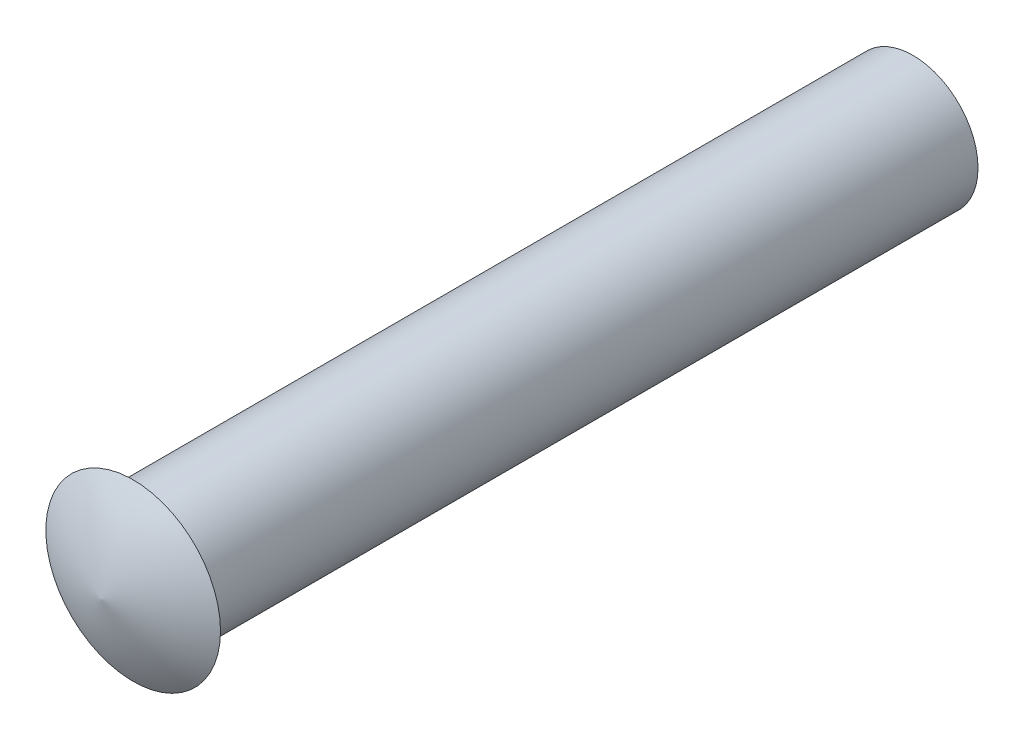
ISO-10303-21;
HEADER;
FILE_DESCRIPTION(('STEP AP214'),'2;1');
FILE_NAME('part.step','',(''),(''),'','','');
FILE_SCHEMA(('AUTOMOTIVE_DESIGN { 1 0 10303 214 1 1 1 1 }'));
ENDSEC;
DATA;
#1=APPLICATION_CONTEXT('core data for automotive mechanical design processes');
#2=APPLICATION_PROTOCOL_DEFINITION('international standard','automotive_design',2000,#1);
#3=PRODUCT_CONTEXT('',#1,'mechanical');
#4=PRODUCT('Part','Part','',(#3));
#5=PRODUCT_RELATED_PRODUCT_CATEGORY('part','',(#4));
#6=PRODUCT_DEFINITION_FORMATION('','',#4);
#7=PRODUCT_DEFINITION_CONTEXT('part definition',#1,'design');
#8=PRODUCT_DEFINITION('design','',#6,#7);
#9=PRODUCT_DEFINITION_SHAPE('','',#8);
#10=(LENGTH_UNIT() NAMED_UNIT(*) SI_UNIT(.MILLI.,.METRE.));
#11=(NAMED_UNIT(*) PLANE_ANGLE_UNIT() SI_UNIT($,.RADIAN.));
#12=(NAMED_UNIT(*) SI_UNIT($,.STERADIAN.) SOLID_ANGLE_UNIT());
#13=UNCERTAINTY_MEASURE_WITH_UNIT(LENGTH_MEASURE(1.E-05),#10,'distance_accuracy_value','');
#14=(GEOMETRIC_REPRESENTATION_CONTEXT(3) GLOBAL_UNCERTAINTY_ASSIGNED_CONTEXT((#13)) GLOBAL_UNIT_ASSIGNED_CONTEXT((#10,
#11,#12)) REPRESENTATION_CONTEXT('',''));
#15=CARTESIAN_POINT('',(0.,0.,0.));
#16=DIRECTION('',(0.,0.,1.));
#17=DIRECTION('',(1.,0.,0.));
#18=AXIS2_PLACEMENT_3D('',#15,#16,#17);
#19=CARTESIAN_POINT('',(-0.881946401721612,0.,-5.67417412079405));
#20=DIRECTION('',(0.,-1.,0.));
#21=DIRECTION('',(1.,0.,0.));
#22=AXIS2_PLACEMENT_3D('',#19,#20,#21);
#23=CIRCLE('',#22,5.74230627958825);
#24=TRIMMED_CURVE('',#23,(PARAMETER_VALUE(-1.41659850452756)),
(PARAMETER_VALUE(1.41659850452756)),.T.,.PARAMETER.);
#25=CARTESIAN_POINT('',(0.,0.,-5.67417412079405));
#26=DIRECTION('',(0.,0.,1.));
#27=AXIS1_PLACEMENT('',#25,#26);
#28=SURFACE_OF_REVOLUTION('',#24,#27);
#29=CARTESIAN_POINT('',(0.,0.,0.));
#30=VERTEX_POINT('',#29);
#31=VERTEX_LOOP('',#30);
#32=FACE_BOUND('',#31,.T.);
#33=CARTESIAN_POINT('',(0.,0.,-0.7874));
#34=DIRECTION('',(0.,0.,1.));
#35=DIRECTION('',(1.,0.,0.));
#36=AXIS2_PLACEMENT_3D('',#33,#34,#35);
#37=CIRCLE('',#36,2.1336);
#38=CARTESIAN_POINT('',(2.1336,0.,-0.7874));
#39=VERTEX_POINT('',#38);
#40=EDGE_CURVE('E11',#39,#39,#37,.T.);
#41=ORIENTED_EDGE('',*,*,#40,.T.);
#42=EDGE_LOOP('',(#41));
#43=FACE_BOUND('',#42,.T.);
#44=ADVANCED_FACE('F39',(#32,#43),#28,.T.);
#45=CARTESIAN_POINT('',(0.,2.1336,-0.7874));
#46=DIRECTION('',(0.,0.,1.));
#47=DIRECTION('',(1.,0.,0.));
#48=AXIS2_PLACEMENT_3D('',#45,#46,#47);
#49=PLANE('',#48);
#50=ORIENTED_EDGE('',*,*,#40,.F.);
#51=EDGE_LOOP('',(#50));
#52=FACE_BOUND('',#51,.T.);
#53=CARTESIAN_POINT('',(0.,0.,-0.7874));
#54=DIRECTION('',(0.,0.,1.));
#55=DIRECTION('',(1.,0.,0.));
#56=AXIS2_PLACEMENT_3D('',#53,#54,#55);
#57=CIRCLE('',#56,1.5875);
#58=CARTESIAN_POINT('',(1.5875,0.,-0.7874));
#59=VERTEX_POINT('',#58);
#60=EDGE_CURVE('E46',#59,#59,#57,.T.);
#61=ORIENTED_EDGE('',*,*,#60,.T.);
#62=EDGE_LOOP('',(#61));
#63=FACE_BOUND('',#62,.T.);
#64=ADVANCED_FACE('F51',(#52,#63),#49,.F.);
#65=CARTESIAN_POINT('',(0.,0.,0.));
#66=DIRECTION('',(0.,0.,1.));
#67=DIRECTION('',(1.,0.,0.));
#68=AXIS2_PLACEMENT_3D('',#65,#66,#67);
#69=CYLINDRICAL_SURFACE('',#68,1.5875);
#70=ORIENTED_EDGE('',*,*,#60,.F.);
#71=EDGE_LOOP('',(#70));
#72=FACE_BOUND('',#71,.T.);
#73=CARTESIAN_POINT('',(0.,0.,-19.8374));
#74=DIRECTION('',(0.,0.,1.));
#75=DIRECTION('',(1.,0.,0.));
#76=AXIS2_PLACEMENT_3D('',#73,#74,#75);
#77=CIRCLE('',#76,1.5875);
#78=CARTESIAN_POINT('',(1.5875,0.,-19.8374));
#79=VERTEX_POINT('',#78);
#80=EDGE_CURVE('E61',#79,#79,#77,.T.);
#81=ORIENTED_EDGE('',*,*,#80,.T.);
#82=EDGE_LOOP('',(#81));
#83=FACE_BOUND('',#82,.T.);
#84=ADVANCED_FACE('F56',(#72,#83),#69,.T.);
#85=CARTESIAN_POINT('',(0.,1.5875,-19.8374));
#86=DIRECTION('',(0.,0.,1.));
#87=DIRECTION('',(1.,0.,0.));
#88=AXIS2_PLACEMENT_3D('',#85,#86,#87);
#89=PLANE('',#88);
#90=ORIENTED_EDGE('',*,*,#80,.F.);
#91=EDGE_LOOP('',(#90));
#92=FACE_BOUND('',#91,.T.);
#93=ADVANCED_FACE('F68',(#92),#89,.F.);
#94=CLOSED_SHELL('',(#44,#64,#84,#93));
#95=MANIFOLD_SOLID_BREP('B2',#94);
#96=ADVANCED_BREP_SHAPE_REPRESENTATION('',(#18,#95),#14);
#97=SHAPE_DEFINITION_REPRESENTATION(#9,#96);
ENDSEC;
END-ISO-10303-21;
